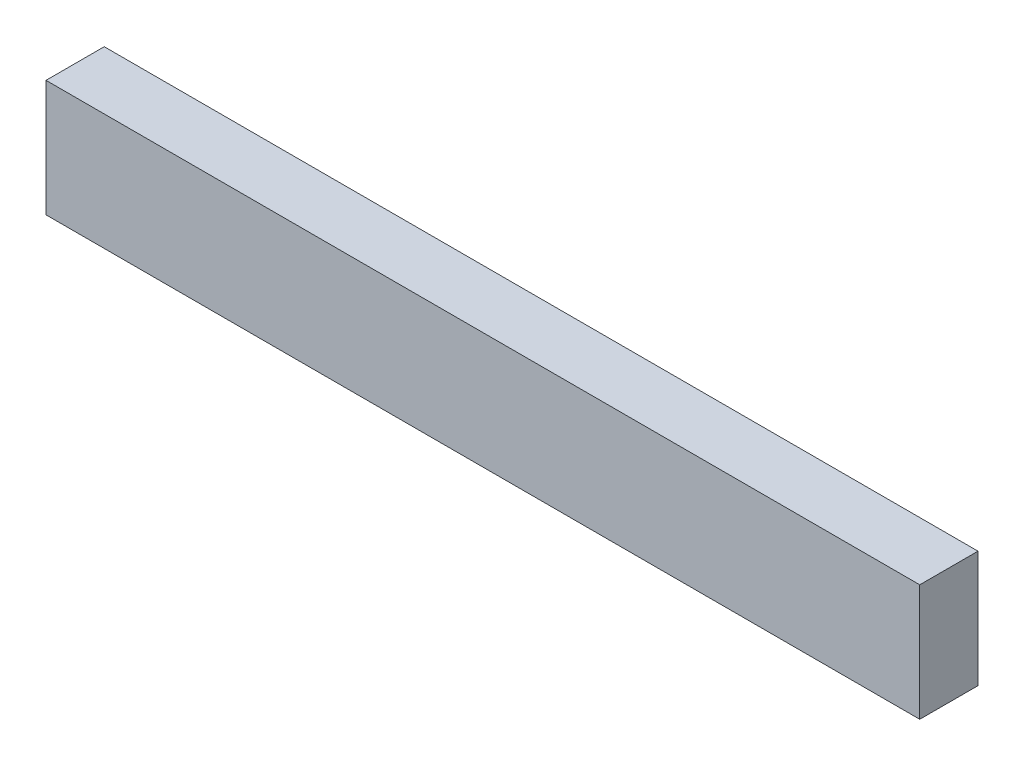
ISO-10303-21;
HEADER;
FILE_DESCRIPTION(('STEP AP214'),'2;1');
FILE_NAME('part.step','',(''),(''),'','','');
FILE_SCHEMA(('AUTOMOTIVE_DESIGN { 1 0 10303 214 1 1 1 1 }'));
ENDSEC;
DATA;
#1=APPLICATION_CONTEXT('core data for automotive mechanical design processes');
#2=APPLICATION_PROTOCOL_DEFINITION('international standard','automotive_design',2000,#1);
#3=PRODUCT_CONTEXT('',#1,'mechanical');
#4=PRODUCT('Part','Part','',(#3));
#5=PRODUCT_RELATED_PRODUCT_CATEGORY('part','',(#4));
#6=PRODUCT_DEFINITION_FORMATION('','',#4);
#7=PRODUCT_DEFINITION_CONTEXT('part definition',#1,'design');
#8=PRODUCT_DEFINITION('design','',#6,#7);
#9=PRODUCT_DEFINITION_SHAPE('','',#8);
#10=(LENGTH_UNIT() NAMED_UNIT(*) SI_UNIT(.MILLI.,.METRE.));
#11=(NAMED_UNIT(*) PLANE_ANGLE_UNIT() SI_UNIT($,.RADIAN.));
#12=(NAMED_UNIT(*) SI_UNIT($,.STERADIAN.) SOLID_ANGLE_UNIT());
#13=UNCERTAINTY_MEASURE_WITH_UNIT(LENGTH_MEASURE(1.E-05),#10,'distance_accuracy_value','');
#14=(GEOMETRIC_REPRESENTATION_CONTEXT(3) GLOBAL_UNCERTAINTY_ASSIGNED_CONTEXT((#13)) GLOBAL_UNIT_ASSIGNED_CONTEXT((#10,
#11,#12)) REPRESENTATION_CONTEXT('',''));
#15=CARTESIAN_POINT('',(0.,0.,0.));
#16=DIRECTION('',(0.,0.,1.));
#17=DIRECTION('',(1.,0.,0.));
#18=AXIS2_PLACEMENT_3D('',#15,#16,#17);
#19=CARTESIAN_POINT('',(75.,-10.,10.));
#20=DIRECTION('',(-1.,0.,0.));
#21=DIRECTION('',(0.,0.,1.));
#22=AXIS2_PLACEMENT_3D('',#19,#20,#21);
#23=PLANE('',#22);
#24=DIRECTION('',(0.,1.,0.));
#25=VECTOR('',#24,1.);
#26=CARTESIAN_POINT('',(75.,-10.,0.));
#27=LINE('',#26,#25);
#28=CARTESIAN_POINT('',(75.,-10.,0.));
#29=VERTEX_POINT('',#28);
#30=CARTESIAN_POINT('',(75.,10.,0.));
#31=VERTEX_POINT('',#30);
#32=EDGE_CURVE('E96',#29,#31,#27,.T.);
#33=ORIENTED_EDGE('',*,*,#32,.T.);
#34=DIRECTION('',(0.,0.,-1.));
#35=VECTOR('',#34,1.);
#36=CARTESIAN_POINT('',(75.,10.,10.));
#37=LINE('',#36,#35);
#38=CARTESIAN_POINT('',(75.,10.,10.));
#39=VERTEX_POINT('',#38);
#40=EDGE_CURVE('E11',#39,#31,#37,.T.);
#41=ORIENTED_EDGE('',*,*,#40,.F.);
#42=DIRECTION('',(0.,1.,0.));
#43=VECTOR('',#42,1.);
#44=CARTESIAN_POINT('',(75.,-10.,10.));
#45=LINE('',#44,#43);
#46=CARTESIAN_POINT('',(75.,-10.,10.));
#47=VERTEX_POINT('',#46);
#48=EDGE_CURVE('E84',#47,#39,#45,.T.);
#49=ORIENTED_EDGE('',*,*,#48,.F.);
#50=DIRECTION('',(0.,0.,-1.));
#51=VECTOR('',#50,1.);
#52=CARTESIAN_POINT('',(75.,-10.,10.));
#53=LINE('',#52,#51);
#54=EDGE_CURVE('E92',#47,#29,#53,.T.);
#55=ORIENTED_EDGE('',*,*,#54,.T.);
#56=EDGE_LOOP('',(#33,#41,#49,#55));
#57=FACE_BOUND('',#56,.T.);
#58=ADVANCED_FACE('F33',(#57),#23,.F.);
#59=CARTESIAN_POINT('',(-75.,10.,10.));
#60=DIRECTION('',(0.,-1.,0.));
#61=DIRECTION('',(0.,0.,-1.));
#62=AXIS2_PLACEMENT_3D('',#59,#60,#61);
#63=PLANE('',#62);
#64=DIRECTION('',(-1.,0.,0.));
#65=VECTOR('',#64,1.);
#66=CARTESIAN_POINT('',(-75.,10.,0.));
#67=LINE('',#66,#65);
#68=CARTESIAN_POINT('',(-75.,10.,0.));
#69=VERTEX_POINT('',#68);
#70=EDGE_CURVE('E88',#31,#69,#67,.T.);
#71=ORIENTED_EDGE('',*,*,#70,.T.);
#72=DIRECTION('',(0.,0.,-1.));
#73=VECTOR('',#72,1.);
#74=CARTESIAN_POINT('',(-75.,10.,10.));
#75=LINE('',#74,#73);
#76=CARTESIAN_POINT('',(-75.,10.,10.));
#77=VERTEX_POINT('',#76);
#78=EDGE_CURVE('E41',#77,#69,#75,.T.);
#79=ORIENTED_EDGE('',*,*,#78,.F.);
#80=DIRECTION('',(-1.,0.,0.));
#81=VECTOR('',#80,1.);
#82=CARTESIAN_POINT('',(-75.,10.,10.));
#83=LINE('',#82,#81);
#84=EDGE_CURVE('E79',#39,#77,#83,.T.);
#85=ORIENTED_EDGE('',*,*,#84,.F.);
#86=ORIENTED_EDGE('',*,*,#40,.T.);
#87=EDGE_LOOP('',(#71,#79,#85,#86));
#88=FACE_BOUND('',#87,.T.);
#89=ADVANCED_FACE('F87',(#88),#63,.F.);
#90=CARTESIAN_POINT('',(-75.,-10.,10.));
#91=DIRECTION('',(1.,0.,0.));
#92=DIRECTION('',(0.,0.,-1.));
#93=AXIS2_PLACEMENT_3D('',#90,#91,#92);
#94=PLANE('',#93);
#95=DIRECTION('',(0.,-1.,0.));
#96=VECTOR('',#95,1.);
#97=CARTESIAN_POINT('',(-75.,-10.,0.));
#98=LINE('',#97,#96);
#99=CARTESIAN_POINT('',(-75.,-10.,0.));
#100=VERTEX_POINT('',#99);
#101=EDGE_CURVE('E66',#69,#100,#98,.T.);
#102=ORIENTED_EDGE('',*,*,#101,.T.);
#103=DIRECTION('',(0.,0.,-1.));
#104=VECTOR('',#103,1.);
#105=CARTESIAN_POINT('',(-75.,-10.,10.));
#106=LINE('',#105,#104);
#107=CARTESIAN_POINT('',(-75.,-10.,10.));
#108=VERTEX_POINT('',#107);
#109=EDGE_CURVE('E89',#108,#100,#106,.T.);
#110=ORIENTED_EDGE('',*,*,#109,.F.);
#111=DIRECTION('',(0.,-1.,0.));
#112=VECTOR('',#111,1.);
#113=CARTESIAN_POINT('',(-75.,-10.,10.));
#114=LINE('',#113,#112);
#115=EDGE_CURVE('E82',#77,#108,#114,.T.);
#116=ORIENTED_EDGE('',*,*,#115,.F.);
#117=ORIENTED_EDGE('',*,*,#78,.T.);
#118=EDGE_LOOP('',(#102,#110,#116,#117));
#119=FACE_BOUND('',#118,.T.);
#120=ADVANCED_FACE('F90',(#119),#94,.F.);
#121=CARTESIAN_POINT('',(-75.,-10.,10.));
#122=DIRECTION('',(0.,1.,0.));
#123=DIRECTION('',(0.,0.,1.));
#124=AXIS2_PLACEMENT_3D('',#121,#122,#123);
#125=PLANE('',#124);
#126=DIRECTION('',(1.,0.,0.));
#127=VECTOR('',#126,1.);
#128=CARTESIAN_POINT('',(-75.,-10.,0.));
#129=LINE('',#128,#127);
#130=EDGE_CURVE('E72',#100,#29,#129,.T.);
#131=ORIENTED_EDGE('',*,*,#130,.T.);
#132=ORIENTED_EDGE('',*,*,#54,.F.);
#133=DIRECTION('',(1.,0.,0.));
#134=VECTOR('',#133,1.);
#135=CARTESIAN_POINT('',(-75.,-10.,10.));
#136=LINE('',#135,#134);
#137=EDGE_CURVE('E49',#108,#47,#136,.T.);
#138=ORIENTED_EDGE('',*,*,#137,.F.);
#139=ORIENTED_EDGE('',*,*,#109,.T.);
#140=EDGE_LOOP('',(#131,#132,#138,#139));
#141=FACE_BOUND('',#140,.T.);
#142=ADVANCED_FACE('F103',(#141),#125,.F.);
#143=CARTESIAN_POINT('',(0.,0.,10.));
#144=DIRECTION('',(0.,0.,-1.));
#145=DIRECTION('',(-1.,0.,0.));
#146=AXIS2_PLACEMENT_3D('',#143,#144,#145);
#147=PLANE('',#146);
#148=ORIENTED_EDGE('',*,*,#48,.T.);
#149=ORIENTED_EDGE('',*,*,#84,.T.);
#150=ORIENTED_EDGE('',*,*,#115,.T.);
#151=ORIENTED_EDGE('',*,*,#137,.T.);
#152=EDGE_LOOP('',(#148,#149,#150,#151));
#153=FACE_BOUND('',#152,.T.);
#154=ADVANCED_FACE('F80',(#153),#147,.F.);
#155=CARTESIAN_POINT('',(0.,0.,0.));
#156=DIRECTION('',(0.,0.,-1.));
#157=DIRECTION('',(-1.,0.,0.));
#158=AXIS2_PLACEMENT_3D('',#155,#156,#157);
#159=PLANE('',#158);
#160=ORIENTED_EDGE('',*,*,#32,.F.);
#161=ORIENTED_EDGE('',*,*,#130,.F.);
#162=ORIENTED_EDGE('',*,*,#101,.F.);
#163=ORIENTED_EDGE('',*,*,#70,.F.);
#164=EDGE_LOOP('',(#160,#161,#162,#163));
#165=FACE_BOUND('',#164,.T.);
#166=ADVANCED_FACE('F106',(#165),#159,.T.);
#167=CLOSED_SHELL('',(#58,#89,#120,#142,#154,#166));
#168=MANIFOLD_SOLID_BREP('B2',#167);
#169=ADVANCED_BREP_SHAPE_REPRESENTATION('',(#18,#168),#14);
#170=SHAPE_DEFINITION_REPRESENTATION(#9,#169);
ENDSEC;
END-ISO-10303-21;
